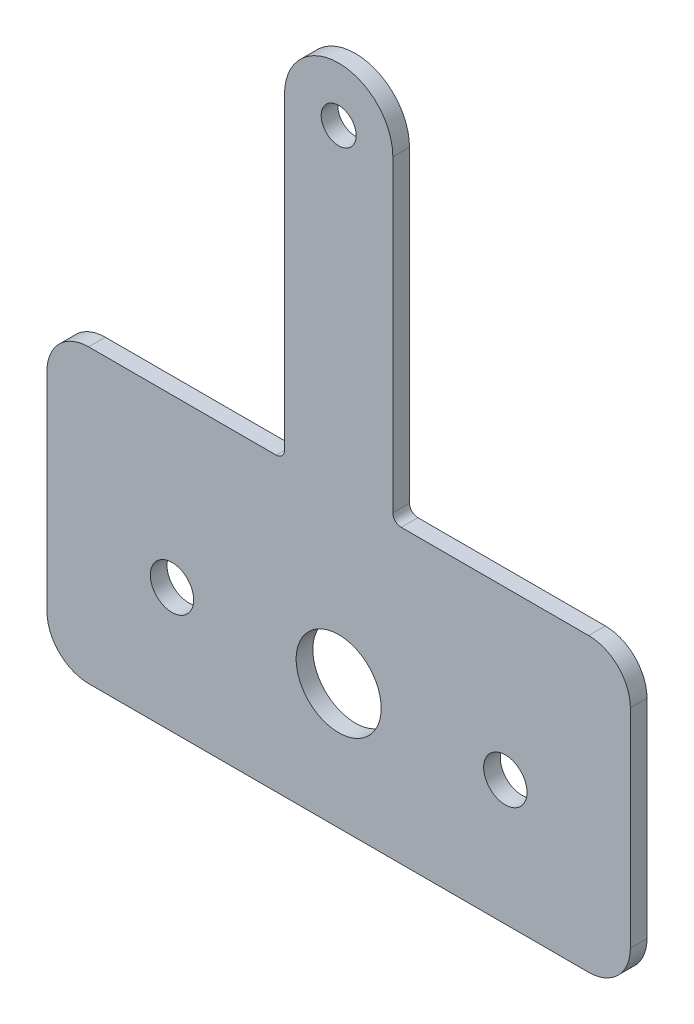
ISO-10303-21;
HEADER;
FILE_DESCRIPTION(('STEP AP214'),'2;1');
FILE_NAME('part.step','',(''),(''),'','','');
FILE_SCHEMA(('AUTOMOTIVE_DESIGN { 1 0 10303 214 1 1 1 1 }'));
ENDSEC;
DATA;
#1=APPLICATION_CONTEXT('core data for automotive mechanical design processes');
#2=APPLICATION_PROTOCOL_DEFINITION('international standard','automotive_design',2000,#1);
#3=PRODUCT_CONTEXT('',#1,'mechanical');
#4=PRODUCT('Part','Part','',(#3));
#5=PRODUCT_RELATED_PRODUCT_CATEGORY('part','',(#4));
#6=PRODUCT_DEFINITION_FORMATION('','',#4);
#7=PRODUCT_DEFINITION_CONTEXT('part definition',#1,'design');
#8=PRODUCT_DEFINITION('design','',#6,#7);
#9=PRODUCT_DEFINITION_SHAPE('','',#8);
#10=(LENGTH_UNIT() NAMED_UNIT(*) SI_UNIT(.MILLI.,.METRE.));
#11=(NAMED_UNIT(*) PLANE_ANGLE_UNIT() SI_UNIT($,.RADIAN.));
#12=(NAMED_UNIT(*) SI_UNIT($,.STERADIAN.) SOLID_ANGLE_UNIT());
#13=UNCERTAINTY_MEASURE_WITH_UNIT(LENGTH_MEASURE(1.E-05),#10,'distance_accuracy_value','');
#14=(GEOMETRIC_REPRESENTATION_CONTEXT(3) GLOBAL_UNCERTAINTY_ASSIGNED_CONTEXT((#13)) GLOBAL_UNIT_ASSIGNED_CONTEXT((#10,
#11,#12)) REPRESENTATION_CONTEXT('',''));
#15=CARTESIAN_POINT('',(0.,0.,0.));
#16=DIRECTION('',(0.,0.,1.));
#17=DIRECTION('',(1.,0.,0.));
#18=AXIS2_PLACEMENT_3D('',#15,#16,#17);
#19=CARTESIAN_POINT('',(0.,58.,-2.));
#20=DIRECTION('',(0.,0.,1.));
#21=DIRECTION('',(1.,0.,0.));
#22=AXIS2_PLACEMENT_3D('',#19,#20,#21);
#23=CYLINDRICAL_SURFACE('',#22,6.5);
#24=CARTESIAN_POINT('',(0.,58.,0.));
#25=DIRECTION('',(0.,0.,1.));
#26=DIRECTION('',(1.,0.,0.));
#27=AXIS2_PLACEMENT_3D('',#24,#25,#26);
#28=CIRCLE('',#27,6.5);
#29=CARTESIAN_POINT('',(6.50000000000005,58.,0.));
#30=VERTEX_POINT('',#29);
#31=CARTESIAN_POINT('',(-6.49999999999995,58.,0.));
#32=VERTEX_POINT('',#31);
#33=EDGE_CURVE('E172',#30,#32,#28,.T.);
#34=ORIENTED_EDGE('',*,*,#33,.F.);
#35=DIRECTION('',(0.,0.,1.));
#36=VECTOR('',#35,1.);
#37=CARTESIAN_POINT('',(6.50000000000005,58.,-2.));
#38=LINE('',#37,#36);
#39=CARTESIAN_POINT('',(6.50000000000005,58.,-2.));
#40=VERTEX_POINT('',#39);
#41=EDGE_CURVE('E11',#40,#30,#38,.T.);
#42=ORIENTED_EDGE('',*,*,#41,.F.);
#43=CARTESIAN_POINT('',(0.,58.,-2.));
#44=DIRECTION('',(0.,0.,1.));
#45=DIRECTION('',(1.,0.,0.));
#46=AXIS2_PLACEMENT_3D('',#43,#44,#45);
#47=CIRCLE('',#46,6.5);
#48=CARTESIAN_POINT('',(-6.49999999999995,58.,-2.));
#49=VERTEX_POINT('',#48);
#50=EDGE_CURVE('E211',#40,#49,#47,.T.);
#51=ORIENTED_EDGE('',*,*,#50,.T.);
#52=DIRECTION('',(0.,0.,1.));
#53=VECTOR('',#52,1.);
#54=CARTESIAN_POINT('',(-6.49999999999995,58.,-2.));
#55=LINE('',#54,#53);
#56=EDGE_CURVE('E42',#49,#32,#55,.T.);
#57=ORIENTED_EDGE('',*,*,#56,.T.);
#58=EDGE_LOOP('',(#34,#42,#51,#57));
#59=FACE_BOUND('',#58,.T.);
#60=ADVANCED_FACE('F39',(#59),#23,.T.);
#61=CARTESIAN_POINT('',(6.50000000000005,58.,-2.));
#62=DIRECTION('',(1.,0.,0.));
#63=DIRECTION('',(0.,1.,0.));
#64=AXIS2_PLACEMENT_3D('',#61,#62,#63);
#65=PLANE('',#64);
#66=DIRECTION('',(0.,1.,0.));
#67=VECTOR('',#66,1.);
#68=CARTESIAN_POINT('',(6.50000000000005,58.,0.));
#69=LINE('',#68,#67);
#70=CARTESIAN_POINT('',(6.50000000000002,21.,0.));
#71=VERTEX_POINT('',#70);
#72=EDGE_CURVE('E209',#71,#30,#69,.T.);
#73=ORIENTED_EDGE('',*,*,#72,.F.);
#74=DIRECTION('',(0.,0.,1.));
#75=VECTOR('',#74,1.);
#76=CARTESIAN_POINT('',(6.50000000000002,21.,-2.));
#77=LINE('',#76,#75);
#78=CARTESIAN_POINT('',(6.50000000000002,21.,-2.));
#79=VERTEX_POINT('',#78);
#80=EDGE_CURVE('E48',#79,#71,#77,.T.);
#81=ORIENTED_EDGE('',*,*,#80,.F.);
#82=DIRECTION('',(0.,1.,0.));
#83=VECTOR('',#82,1.);
#84=CARTESIAN_POINT('',(6.50000000000005,58.,-2.));
#85=LINE('',#84,#83);
#86=EDGE_CURVE('E162',#79,#40,#85,.T.);
#87=ORIENTED_EDGE('',*,*,#86,.T.);
#88=ORIENTED_EDGE('',*,*,#41,.T.);
#89=EDGE_LOOP('',(#73,#81,#87,#88));
#90=FACE_BOUND('',#89,.T.);
#91=ADVANCED_FACE('F235',(#90),#65,.T.);
#92=CARTESIAN_POINT('',(7.50000000000002,21.,-2.));
#93=DIRECTION('',(0.,0.,1.));
#94=DIRECTION('',(1.,0.,0.));
#95=AXIS2_PLACEMENT_3D('',#92,#93,#94);
#96=CYLINDRICAL_SURFACE('',#95,1.);
#97=CARTESIAN_POINT('',(7.50000000000002,21.,0.));
#98=DIRECTION('',(0.,0.,-1.));
#99=DIRECTION('',(1.,0.,0.));
#100=AXIS2_PLACEMENT_3D('',#97,#98,#99);
#101=CIRCLE('',#100,1.);
#102=CARTESIAN_POINT('',(7.50000000000002,20.,0.));
#103=VERTEX_POINT('',#102);
#104=EDGE_CURVE('E149',#103,#71,#101,.T.);
#105=ORIENTED_EDGE('',*,*,#104,.F.);
#106=DIRECTION('',(0.,0.,1.));
#107=VECTOR('',#106,1.);
#108=CARTESIAN_POINT('',(7.50000000000002,20.,-2.));
#109=LINE('',#108,#107);
#110=CARTESIAN_POINT('',(7.50000000000002,20.,-2.));
#111=VERTEX_POINT('',#110);
#112=EDGE_CURVE('E144',#111,#103,#109,.T.);
#113=ORIENTED_EDGE('',*,*,#112,.F.);
#114=CARTESIAN_POINT('',(7.50000000000002,21.,-2.));
#115=DIRECTION('',(0.,0.,-1.));
#116=DIRECTION('',(1.,0.,0.));
#117=AXIS2_PLACEMENT_3D('',#114,#115,#116);
#118=CIRCLE('',#117,1.);
#119=EDGE_CURVE('E147',#111,#79,#118,.T.);
#120=ORIENTED_EDGE('',*,*,#119,.T.);
#121=ORIENTED_EDGE('',*,*,#80,.T.);
#122=EDGE_LOOP('',(#105,#113,#120,#121));
#123=FACE_BOUND('',#122,.T.);
#124=ADVANCED_FACE('F146',(#123),#96,.F.);
#125=CARTESIAN_POINT('',(30.,20.,-2.));
#126=DIRECTION('',(0.,1.,0.));
#127=DIRECTION('',(-1.,0.,0.));
#128=AXIS2_PLACEMENT_3D('',#125,#126,#127);
#129=PLANE('',#128);
#130=DIRECTION('',(-1.,0.,0.));
#131=VECTOR('',#130,1.);
#132=CARTESIAN_POINT('',(30.,20.,0.));
#133=LINE('',#132,#131);
#134=CARTESIAN_POINT('',(30.,20.,0.));
#135=VERTEX_POINT('',#134);
#136=EDGE_CURVE('E206',#135,#103,#133,.T.);
#137=ORIENTED_EDGE('',*,*,#136,.F.);
#138=DIRECTION('',(0.,0.,1.));
#139=VECTOR('',#138,1.);
#140=CARTESIAN_POINT('',(30.,20.,-2.));
#141=LINE('',#140,#139);
#142=CARTESIAN_POINT('',(30.,20.,-2.));
#143=VERTEX_POINT('',#142);
#144=EDGE_CURVE('E154',#143,#135,#141,.T.);
#145=ORIENTED_EDGE('',*,*,#144,.F.);
#146=DIRECTION('',(-1.,0.,0.));
#147=VECTOR('',#146,1.);
#148=CARTESIAN_POINT('',(30.,20.,-2.));
#149=LINE('',#148,#147);
#150=EDGE_CURVE('E160',#143,#111,#149,.T.);
#151=ORIENTED_EDGE('',*,*,#150,.T.);
#152=ORIENTED_EDGE('',*,*,#112,.T.);
#153=EDGE_LOOP('',(#137,#145,#151,#152));
#154=FACE_BOUND('',#153,.T.);
#155=ADVANCED_FACE('F164',(#154),#129,.T.);
#156=CARTESIAN_POINT('',(30.,15.,-2.));
#157=DIRECTION('',(0.,0.,1.));
#158=DIRECTION('',(1.,0.,0.));
#159=AXIS2_PLACEMENT_3D('',#156,#157,#158);
#160=CYLINDRICAL_SURFACE('',#159,5.);
#161=CARTESIAN_POINT('',(30.,15.,0.));
#162=DIRECTION('',(0.,0.,1.));
#163=DIRECTION('',(1.,0.,0.));
#164=AXIS2_PLACEMENT_3D('',#161,#162,#163);
#165=CIRCLE('',#164,5.);
#166=CARTESIAN_POINT('',(35.,15.,0.));
#167=VERTEX_POINT('',#166);
#168=EDGE_CURVE('E203',#167,#135,#165,.T.);
#169=ORIENTED_EDGE('',*,*,#168,.F.);
#170=DIRECTION('',(0.,0.,1.));
#171=VECTOR('',#170,1.);
#172=CARTESIAN_POINT('',(35.,15.,-2.));
#173=LINE('',#172,#171);
#174=CARTESIAN_POINT('',(35.,15.,-2.));
#175=VERTEX_POINT('',#174);
#176=EDGE_CURVE('E215',#175,#167,#173,.T.);
#177=ORIENTED_EDGE('',*,*,#176,.F.);
#178=CARTESIAN_POINT('',(30.,15.,-2.));
#179=DIRECTION('',(0.,0.,1.));
#180=DIRECTION('',(1.,0.,0.));
#181=AXIS2_PLACEMENT_3D('',#178,#179,#180);
#182=CIRCLE('',#181,5.);
#183=EDGE_CURVE('E165',#175,#143,#182,.T.);
#184=ORIENTED_EDGE('',*,*,#183,.T.);
#185=ORIENTED_EDGE('',*,*,#144,.T.);
#186=EDGE_LOOP('',(#169,#177,#184,#185));
#187=FACE_BOUND('',#186,.T.);
#188=ADVANCED_FACE('F248',(#187),#160,.T.);
#189=CARTESIAN_POINT('',(35.,-10.,-2.));
#190=DIRECTION('',(1.,0.,0.));
#191=DIRECTION('',(0.,1.,0.));
#192=AXIS2_PLACEMENT_3D('',#189,#190,#191);
#193=PLANE('',#192);
#194=DIRECTION('',(0.,1.,0.));
#195=VECTOR('',#194,1.);
#196=CARTESIAN_POINT('',(35.,-10.,0.));
#197=LINE('',#196,#195);
#198=CARTESIAN_POINT('',(35.,-10.,0.));
#199=VERTEX_POINT('',#198);
#200=EDGE_CURVE('E200',#199,#167,#197,.T.);
#201=ORIENTED_EDGE('',*,*,#200,.F.);
#202=DIRECTION('',(0.,0.,1.));
#203=VECTOR('',#202,1.);
#204=CARTESIAN_POINT('',(35.,-10.,-2.));
#205=LINE('',#204,#203);
#206=CARTESIAN_POINT('',(35.,-10.,-2.));
#207=VERTEX_POINT('',#206);
#208=EDGE_CURVE('E217',#207,#199,#205,.T.);
#209=ORIENTED_EDGE('',*,*,#208,.F.);
#210=DIRECTION('',(0.,1.,0.));
#211=VECTOR('',#210,1.);
#212=CARTESIAN_POINT('',(35.,-10.,-2.));
#213=LINE('',#212,#211);
#214=EDGE_CURVE('E167',#207,#175,#213,.T.);
#215=ORIENTED_EDGE('',*,*,#214,.T.);
#216=ORIENTED_EDGE('',*,*,#176,.T.);
#217=EDGE_LOOP('',(#201,#209,#215,#216));
#218=FACE_BOUND('',#217,.T.);
#219=ADVANCED_FACE('F251',(#218),#193,.T.);
#220=CARTESIAN_POINT('',(30.,-10.,-2.));
#221=DIRECTION('',(0.,0.,1.));
#222=DIRECTION('',(1.,0.,0.));
#223=AXIS2_PLACEMENT_3D('',#220,#221,#222);
#224=CYLINDRICAL_SURFACE('',#223,5.);
#225=CARTESIAN_POINT('',(30.,-10.,0.));
#226=DIRECTION('',(0.,0.,1.));
#227=DIRECTION('',(1.,0.,0.));
#228=AXIS2_PLACEMENT_3D('',#225,#226,#227);
#229=CIRCLE('',#228,5.);
#230=CARTESIAN_POINT('',(30.,-15.,0.));
#231=VERTEX_POINT('',#230);
#232=EDGE_CURVE('E197',#231,#199,#229,.T.);
#233=ORIENTED_EDGE('',*,*,#232,.F.);
#234=DIRECTION('',(0.,0.,1.));
#235=VECTOR('',#234,1.);
#236=CARTESIAN_POINT('',(30.,-15.,-2.));
#237=LINE('',#236,#235);
#238=CARTESIAN_POINT('',(30.,-15.,-2.));
#239=VERTEX_POINT('',#238);
#240=EDGE_CURVE('E219',#239,#231,#237,.T.);
#241=ORIENTED_EDGE('',*,*,#240,.F.);
#242=CARTESIAN_POINT('',(30.,-10.,-2.));
#243=DIRECTION('',(0.,0.,1.));
#244=DIRECTION('',(1.,0.,0.));
#245=AXIS2_PLACEMENT_3D('',#242,#243,#244);
#246=CIRCLE('',#245,5.);
#247=EDGE_CURVE('E359',#239,#207,#246,.T.);
#248=ORIENTED_EDGE('',*,*,#247,.T.);
#249=ORIENTED_EDGE('',*,*,#208,.T.);
#250=EDGE_LOOP('',(#233,#241,#248,#249));
#251=FACE_BOUND('',#250,.T.);
#252=ADVANCED_FACE('F255',(#251),#224,.T.);
#253=CARTESIAN_POINT('',(-30.,-15.,-2.));
#254=DIRECTION('',(0.,-1.,0.));
#255=DIRECTION('',(0.,0.,-1.));
#256=AXIS2_PLACEMENT_3D('',#253,#254,#255);
#257=PLANE('',#256);
#258=DIRECTION('',(1.,0.,0.));
#259=VECTOR('',#258,1.);
#260=CARTESIAN_POINT('',(-30.,-15.,0.));
#261=LINE('',#260,#259);
#262=CARTESIAN_POINT('',(-30.,-15.,0.));
#263=VERTEX_POINT('',#262);
#264=EDGE_CURVE('E194',#263,#231,#261,.T.);
#265=ORIENTED_EDGE('',*,*,#264,.F.);
#266=DIRECTION('',(0.,0.,1.));
#267=VECTOR('',#266,1.);
#268=CARTESIAN_POINT('',(-30.,-15.,-2.));
#269=LINE('',#268,#267);
#270=CARTESIAN_POINT('',(-30.,-15.,-2.));
#271=VERTEX_POINT('',#270);
#272=EDGE_CURVE('E221',#271,#263,#269,.T.);
#273=ORIENTED_EDGE('',*,*,#272,.F.);
#274=DIRECTION('',(1.,0.,0.));
#275=VECTOR('',#274,1.);
#276=CARTESIAN_POINT('',(-30.,-15.,-2.));
#277=LINE('',#276,#275);
#278=EDGE_CURVE('E356',#271,#239,#277,.T.);
#279=ORIENTED_EDGE('',*,*,#278,.T.);
#280=ORIENTED_EDGE('',*,*,#240,.T.);
#281=EDGE_LOOP('',(#265,#273,#279,#280));
#282=FACE_BOUND('',#281,.T.);
#283=ADVANCED_FACE('F259',(#282),#257,.T.);
#284=CARTESIAN_POINT('',(-30.,-10.,-2.));
#285=DIRECTION('',(0.,0.,1.));
#286=DIRECTION('',(1.,0.,0.));
#287=AXIS2_PLACEMENT_3D('',#284,#285,#286);
#288=CYLINDRICAL_SURFACE('',#287,5.00000000000001);
#289=CARTESIAN_POINT('',(-30.,-10.,0.));
#290=DIRECTION('',(0.,0.,1.));
#291=DIRECTION('',(1.,0.,0.));
#292=AXIS2_PLACEMENT_3D('',#289,#290,#291);
#293=CIRCLE('',#292,5.00000000000001);
#294=CARTESIAN_POINT('',(-35.,-10.,0.));
#295=VERTEX_POINT('',#294);
#296=EDGE_CURVE('E191',#295,#263,#293,.T.);
#297=ORIENTED_EDGE('',*,*,#296,.F.);
#298=DIRECTION('',(0.,0.,1.));
#299=VECTOR('',#298,1.);
#300=CARTESIAN_POINT('',(-35.,-10.,-2.));
#301=LINE('',#300,#299);
#302=CARTESIAN_POINT('',(-35.,-10.,-2.));
#303=VERTEX_POINT('',#302);
#304=EDGE_CURVE('E223',#303,#295,#301,.T.);
#305=ORIENTED_EDGE('',*,*,#304,.F.);
#306=CARTESIAN_POINT('',(-30.,-10.,-2.));
#307=DIRECTION('',(0.,0.,1.));
#308=DIRECTION('',(1.,0.,0.));
#309=AXIS2_PLACEMENT_3D('',#306,#307,#308);
#310=CIRCLE('',#309,5.00000000000001);
#311=EDGE_CURVE('E353',#303,#271,#310,.T.);
#312=ORIENTED_EDGE('',*,*,#311,.T.);
#313=ORIENTED_EDGE('',*,*,#272,.T.);
#314=EDGE_LOOP('',(#297,#305,#312,#313));
#315=FACE_BOUND('',#314,.T.);
#316=ADVANCED_FACE('F263',(#315),#288,.T.);
#317=CARTESIAN_POINT('',(-35.,15.,-2.));
#318=DIRECTION('',(-1.,0.,0.));
#319=DIRECTION('',(0.,-1.,0.));
#320=AXIS2_PLACEMENT_3D('',#317,#318,#319);
#321=PLANE('',#320);
#322=DIRECTION('',(0.,-1.,0.));
#323=VECTOR('',#322,1.);
#324=CARTESIAN_POINT('',(-35.,15.,0.));
#325=LINE('',#324,#323);
#326=CARTESIAN_POINT('',(-35.,15.,0.));
#327=VERTEX_POINT('',#326);
#328=EDGE_CURVE('E188',#327,#295,#325,.T.);
#329=ORIENTED_EDGE('',*,*,#328,.F.);
#330=DIRECTION('',(0.,0.,1.));
#331=VECTOR('',#330,1.);
#332=CARTESIAN_POINT('',(-35.,15.,-2.));
#333=LINE('',#332,#331);
#334=CARTESIAN_POINT('',(-35.,15.,-2.));
#335=VERTEX_POINT('',#334);
#336=EDGE_CURVE('E225',#335,#327,#333,.T.);
#337=ORIENTED_EDGE('',*,*,#336,.F.);
#338=DIRECTION('',(0.,-1.,0.));
#339=VECTOR('',#338,1.);
#340=CARTESIAN_POINT('',(-35.,15.,-2.));
#341=LINE('',#340,#339);
#342=EDGE_CURVE('E350',#335,#303,#341,.T.);
#343=ORIENTED_EDGE('',*,*,#342,.T.);
#344=ORIENTED_EDGE('',*,*,#304,.T.);
#345=EDGE_LOOP('',(#329,#337,#343,#344));
#346=FACE_BOUND('',#345,.T.);
#347=ADVANCED_FACE('F267',(#346),#321,.T.);
#348=CARTESIAN_POINT('',(-30.,15.,-2.));
#349=DIRECTION('',(0.,0.,1.));
#350=DIRECTION('',(1.,0.,0.));
#351=AXIS2_PLACEMENT_3D('',#348,#349,#350);
#352=CYLINDRICAL_SURFACE('',#351,5.);
#353=CARTESIAN_POINT('',(-30.,15.,0.));
#354=DIRECTION('',(0.,0.,1.));
#355=DIRECTION('',(-1.,0.,0.));
#356=AXIS2_PLACEMENT_3D('',#353,#354,#355);
#357=CIRCLE('',#356,5.);
#358=CARTESIAN_POINT('',(-30.,20.,0.));
#359=VERTEX_POINT('',#358);
#360=EDGE_CURVE('E185',#359,#327,#357,.T.);
#361=ORIENTED_EDGE('',*,*,#360,.F.);
#362=DIRECTION('',(0.,0.,1.));
#363=VECTOR('',#362,1.);
#364=CARTESIAN_POINT('',(-30.,20.,-2.));
#365=LINE('',#364,#363);
#366=CARTESIAN_POINT('',(-30.,20.,-2.));
#367=VERTEX_POINT('',#366);
#368=EDGE_CURVE('E227',#367,#359,#365,.T.);
#369=ORIENTED_EDGE('',*,*,#368,.F.);
#370=CARTESIAN_POINT('',(-30.,15.,-2.));
#371=DIRECTION('',(0.,0.,1.));
#372=DIRECTION('',(-1.,0.,0.));
#373=AXIS2_PLACEMENT_3D('',#370,#371,#372);
#374=CIRCLE('',#373,5.);
#375=EDGE_CURVE('E347',#367,#335,#374,.T.);
#376=ORIENTED_EDGE('',*,*,#375,.T.);
#377=ORIENTED_EDGE('',*,*,#336,.T.);
#378=EDGE_LOOP('',(#361,#369,#376,#377));
#379=FACE_BOUND('',#378,.T.);
#380=ADVANCED_FACE('F271',(#379),#352,.T.);
#381=CARTESIAN_POINT('',(-7.49999999999999,20.,-2.));
#382=DIRECTION('',(0.,1.,0.));
#383=DIRECTION('',(-1.,0.,0.));
#384=AXIS2_PLACEMENT_3D('',#381,#382,#383);
#385=PLANE('',#384);
#386=DIRECTION('',(-1.,0.,0.));
#387=VECTOR('',#386,1.);
#388=CARTESIAN_POINT('',(-7.49999999999999,20.,0.));
#389=LINE('',#388,#387);
#390=CARTESIAN_POINT('',(-7.49999999999999,20.,0.));
#391=VERTEX_POINT('',#390);
#392=EDGE_CURVE('E182',#391,#359,#389,.T.);
#393=ORIENTED_EDGE('',*,*,#392,.F.);
#394=DIRECTION('',(0.,0.,1.));
#395=VECTOR('',#394,1.);
#396=CARTESIAN_POINT('',(-7.49999999999999,20.,-2.));
#397=LINE('',#396,#395);
#398=CARTESIAN_POINT('',(-7.49999999999999,20.,-2.));
#399=VERTEX_POINT('',#398);
#400=EDGE_CURVE('E229',#399,#391,#397,.T.);
#401=ORIENTED_EDGE('',*,*,#400,.F.);
#402=DIRECTION('',(-1.,0.,0.));
#403=VECTOR('',#402,1.);
#404=CARTESIAN_POINT('',(-7.49999999999999,20.,-2.));
#405=LINE('',#404,#403);
#406=EDGE_CURVE('E344',#399,#367,#405,.T.);
#407=ORIENTED_EDGE('',*,*,#406,.T.);
#408=ORIENTED_EDGE('',*,*,#368,.T.);
#409=EDGE_LOOP('',(#393,#401,#407,#408));
#410=FACE_BOUND('',#409,.T.);
#411=ADVANCED_FACE('F275',(#410),#385,.T.);
#412=CARTESIAN_POINT('',(-7.49999999999999,21.,-2.));
#413=DIRECTION('',(0.,0.,1.));
#414=DIRECTION('',(1.,0.,0.));
#415=AXIS2_PLACEMENT_3D('',#412,#413,#414);
#416=CYLINDRICAL_SURFACE('',#415,1.);
#417=CARTESIAN_POINT('',(-7.49999999999999,21.,0.));
#418=DIRECTION('',(0.,0.,-1.));
#419=DIRECTION('',(-1.,0.,0.));
#420=AXIS2_PLACEMENT_3D('',#417,#418,#419);
#421=CIRCLE('',#420,1.);
#422=CARTESIAN_POINT('',(-6.49999999999999,21.,0.));
#423=VERTEX_POINT('',#422);
#424=EDGE_CURVE('E179',#423,#391,#421,.T.);
#425=ORIENTED_EDGE('',*,*,#424,.F.);
#426=DIRECTION('',(0.,0.,1.));
#427=VECTOR('',#426,1.);
#428=CARTESIAN_POINT('',(-6.49999999999999,21.,-2.));
#429=LINE('',#428,#427);
#430=CARTESIAN_POINT('',(-6.49999999999999,21.,-2.));
#431=VERTEX_POINT('',#430);
#432=EDGE_CURVE('E230',#431,#423,#429,.T.);
#433=ORIENTED_EDGE('',*,*,#432,.F.);
#434=CARTESIAN_POINT('',(-7.49999999999999,21.,-2.));
#435=DIRECTION('',(0.,0.,-1.));
#436=DIRECTION('',(-1.,0.,0.));
#437=AXIS2_PLACEMENT_3D('',#434,#435,#436);
#438=CIRCLE('',#437,1.);
#439=EDGE_CURVE('E341',#431,#399,#438,.T.);
#440=ORIENTED_EDGE('',*,*,#439,.T.);
#441=ORIENTED_EDGE('',*,*,#400,.T.);
#442=EDGE_LOOP('',(#425,#433,#440,#441));
#443=FACE_BOUND('',#442,.T.);
#444=ADVANCED_FACE('F279',(#443),#416,.F.);
#445=CARTESIAN_POINT('',(-6.49999999999995,58.,-2.));
#446=DIRECTION('',(-1.,0.,0.));
#447=DIRECTION('',(0.,-1.,0.));
#448=AXIS2_PLACEMENT_3D('',#445,#446,#447);
#449=PLANE('',#448);
#450=DIRECTION('',(0.,-1.,0.));
#451=VECTOR('',#450,1.);
#452=CARTESIAN_POINT('',(-6.49999999999995,58.,0.));
#453=LINE('',#452,#451);
#454=EDGE_CURVE('E175',#32,#423,#453,.T.);
#455=ORIENTED_EDGE('',*,*,#454,.F.);
#456=ORIENTED_EDGE('',*,*,#56,.F.);
#457=DIRECTION('',(0.,-1.,0.));
#458=VECTOR('',#457,1.);
#459=CARTESIAN_POINT('',(-6.49999999999995,58.,-2.));
#460=LINE('',#459,#458);
#461=EDGE_CURVE('E339',#49,#431,#460,.T.);
#462=ORIENTED_EDGE('',*,*,#461,.T.);
#463=ORIENTED_EDGE('',*,*,#432,.T.);
#464=EDGE_LOOP('',(#455,#456,#462,#463));
#465=FACE_BOUND('',#464,.T.);
#466=ADVANCED_FACE('F232',(#465),#449,.T.);
#467=CARTESIAN_POINT('',(0.,58.,-2.));
#468=DIRECTION('',(0.,0.,1.));
#469=DIRECTION('',(1.,0.,0.));
#470=AXIS2_PLACEMENT_3D('',#467,#468,#469);
#471=PLANE('',#470);
#472=CARTESIAN_POINT('',(0.,58.,-2.));
#473=DIRECTION('',(0.,0.,1.));
#474=DIRECTION('',(1.,0.,0.));
#475=AXIS2_PLACEMENT_3D('',#472,#473,#474);
#476=CIRCLE('',#475,2.1);
#477=CARTESIAN_POINT('',(2.09999999999998,58.,-2.));
#478=VERTEX_POINT('',#477);
#479=EDGE_CURVE('E314',#478,#478,#476,.T.);
#480=ORIENTED_EDGE('',*,*,#479,.T.);
#481=EDGE_LOOP('',(#480));
#482=FACE_BOUND('',#481,.T.);
#483=CARTESIAN_POINT('',(20.,0.,-2.));
#484=DIRECTION('',(0.,0.,1.));
#485=DIRECTION('',(1.,0.,0.));
#486=AXIS2_PLACEMENT_3D('',#483,#484,#485);
#487=CIRCLE('',#486,2.6);
#488=CARTESIAN_POINT('',(22.6,0.,-2.));
#489=VERTEX_POINT('',#488);
#490=EDGE_CURVE('E322',#489,#489,#487,.T.);
#491=ORIENTED_EDGE('',*,*,#490,.T.);
#492=EDGE_LOOP('',(#491));
#493=FACE_BOUND('',#492,.T.);
#494=CARTESIAN_POINT('',(0.,0.,-2.));
#495=DIRECTION('',(0.,0.,1.));
#496=DIRECTION('',(1.,0.,0.));
#497=AXIS2_PLACEMENT_3D('',#494,#495,#496);
#498=CIRCLE('',#497,5.1);
#499=CARTESIAN_POINT('',(5.1,0.,-2.));
#500=VERTEX_POINT('',#499);
#501=EDGE_CURVE('E328',#500,#500,#498,.T.);
#502=ORIENTED_EDGE('',*,*,#501,.T.);
#503=EDGE_LOOP('',(#502));
#504=FACE_BOUND('',#503,.T.);
#505=CARTESIAN_POINT('',(-20.,0.,-2.));
#506=DIRECTION('',(0.,0.,1.));
#507=DIRECTION('',(1.,0.,0.));
#508=AXIS2_PLACEMENT_3D('',#505,#506,#507);
#509=CIRCLE('',#508,2.6);
#510=CARTESIAN_POINT('',(-17.4,0.,-2.));
#511=VERTEX_POINT('',#510);
#512=EDGE_CURVE('E176',#511,#511,#509,.T.);
#513=ORIENTED_EDGE('',*,*,#512,.T.);
#514=EDGE_LOOP('',(#513));
#515=FACE_BOUND('',#514,.T.);
#516=ORIENTED_EDGE('',*,*,#50,.F.);
#517=ORIENTED_EDGE('',*,*,#86,.F.);
#518=ORIENTED_EDGE('',*,*,#119,.F.);
#519=ORIENTED_EDGE('',*,*,#150,.F.);
#520=ORIENTED_EDGE('',*,*,#183,.F.);
#521=ORIENTED_EDGE('',*,*,#214,.F.);
#522=ORIENTED_EDGE('',*,*,#247,.F.);
#523=ORIENTED_EDGE('',*,*,#278,.F.);
#524=ORIENTED_EDGE('',*,*,#311,.F.);
#525=ORIENTED_EDGE('',*,*,#342,.F.);
#526=ORIENTED_EDGE('',*,*,#375,.F.);
#527=ORIENTED_EDGE('',*,*,#406,.F.);
#528=ORIENTED_EDGE('',*,*,#439,.F.);
#529=ORIENTED_EDGE('',*,*,#461,.F.);
#530=EDGE_LOOP('',(#516,#517,#518,#519,#520,#521,#522,#523,#524,#525,#526,#527,#528,#529));
#531=FACE_BOUND('',#530,.T.);
#532=ADVANCED_FACE('F158',(#482,#493,#504,#515,#531),#471,.F.);
#533=CARTESIAN_POINT('',(0.,58.,0.));
#534=DIRECTION('',(0.,0.,1.));
#535=DIRECTION('',(1.,0.,0.));
#536=AXIS2_PLACEMENT_3D('',#533,#534,#535);
#537=PLANE('',#536);
#538=CARTESIAN_POINT('',(0.,58.,0.));
#539=DIRECTION('',(0.,0.,1.));
#540=DIRECTION('',(1.,0.,0.));
#541=AXIS2_PLACEMENT_3D('',#538,#539,#540);
#542=CIRCLE('',#541,2.1);
#543=CARTESIAN_POINT('',(2.09999999999998,58.,0.));
#544=VERTEX_POINT('',#543);
#545=EDGE_CURVE('E317',#544,#544,#542,.T.);
#546=ORIENTED_EDGE('',*,*,#545,.F.);
#547=EDGE_LOOP('',(#546));
#548=FACE_BOUND('',#547,.T.);
#549=CARTESIAN_POINT('',(20.,0.,0.));
#550=DIRECTION('',(0.,0.,1.));
#551=DIRECTION('',(1.,0.,0.));
#552=AXIS2_PLACEMENT_3D('',#549,#550,#551);
#553=CIRCLE('',#552,2.6);
#554=CARTESIAN_POINT('',(22.6,0.,0.));
#555=VERTEX_POINT('',#554);
#556=EDGE_CURVE('E319',#555,#555,#553,.T.);
#557=ORIENTED_EDGE('',*,*,#556,.F.);
#558=EDGE_LOOP('',(#557));
#559=FACE_BOUND('',#558,.T.);
#560=CARTESIAN_POINT('',(0.,0.,0.));
#561=DIRECTION('',(0.,0.,1.));
#562=DIRECTION('',(1.,0.,0.));
#563=AXIS2_PLACEMENT_3D('',#560,#561,#562);
#564=CIRCLE('',#563,5.1);
#565=CARTESIAN_POINT('',(5.1,0.,0.));
#566=VERTEX_POINT('',#565);
#567=EDGE_CURVE('E325',#566,#566,#564,.T.);
#568=ORIENTED_EDGE('',*,*,#567,.F.);
#569=EDGE_LOOP('',(#568));
#570=FACE_BOUND('',#569,.T.);
#571=CARTESIAN_POINT('',(-20.,0.,0.));
#572=DIRECTION('',(0.,0.,1.));
#573=DIRECTION('',(1.,0.,0.));
#574=AXIS2_PLACEMENT_3D('',#571,#572,#573);
#575=CIRCLE('',#574,2.6);
#576=CARTESIAN_POINT('',(-17.4,0.,0.));
#577=VERTEX_POINT('',#576);
#578=EDGE_CURVE('E331',#577,#577,#575,.T.);
#579=ORIENTED_EDGE('',*,*,#578,.F.);
#580=EDGE_LOOP('',(#579));
#581=FACE_BOUND('',#580,.T.);
#582=ORIENTED_EDGE('',*,*,#33,.T.);
#583=ORIENTED_EDGE('',*,*,#454,.T.);
#584=ORIENTED_EDGE('',*,*,#424,.T.);
#585=ORIENTED_EDGE('',*,*,#392,.T.);
#586=ORIENTED_EDGE('',*,*,#360,.T.);
#587=ORIENTED_EDGE('',*,*,#328,.T.);
#588=ORIENTED_EDGE('',*,*,#296,.T.);
#589=ORIENTED_EDGE('',*,*,#264,.T.);
#590=ORIENTED_EDGE('',*,*,#232,.T.);
#591=ORIENTED_EDGE('',*,*,#200,.T.);
#592=ORIENTED_EDGE('',*,*,#168,.T.);
#593=ORIENTED_EDGE('',*,*,#136,.T.);
#594=ORIENTED_EDGE('',*,*,#104,.T.);
#595=ORIENTED_EDGE('',*,*,#72,.T.);
#596=EDGE_LOOP('',(#582,#583,#584,#585,#586,#587,#588,#589,#590,#591,#592,#593,#594,#595));
#597=FACE_BOUND('',#596,.T.);
#598=ADVANCED_FACE('F234',(#548,#559,#570,#581,#597),#537,.T.);
#599=CARTESIAN_POINT('',(-20.,0.,-2.));
#600=DIRECTION('',(0.,0.,1.));
#601=DIRECTION('',(1.,0.,0.));
#602=AXIS2_PLACEMENT_3D('',#599,#600,#601);
#603=CYLINDRICAL_SURFACE('',#602,2.6);
#604=ORIENTED_EDGE('',*,*,#512,.F.);
#605=EDGE_LOOP('',(#604));
#606=FACE_BOUND('',#605,.T.);
#607=ORIENTED_EDGE('',*,*,#578,.T.);
#608=EDGE_LOOP('',(#607));
#609=FACE_BOUND('',#608,.T.);
#610=ADVANCED_FACE('F291',(#606,#609),#603,.F.);
#611=CARTESIAN_POINT('',(0.,0.,-2.));
#612=DIRECTION('',(0.,0.,1.));
#613=DIRECTION('',(1.,0.,0.));
#614=AXIS2_PLACEMENT_3D('',#611,#612,#613);
#615=CYLINDRICAL_SURFACE('',#614,5.1);
#616=ORIENTED_EDGE('',*,*,#501,.F.);
#617=EDGE_LOOP('',(#616));
#618=FACE_BOUND('',#617,.T.);
#619=ORIENTED_EDGE('',*,*,#567,.T.);
#620=EDGE_LOOP('',(#619));
#621=FACE_BOUND('',#620,.T.);
#622=ADVANCED_FACE('F298',(#618,#621),#615,.F.);
#623=CARTESIAN_POINT('',(20.,0.,-2.));
#624=DIRECTION('',(0.,0.,1.));
#625=DIRECTION('',(1.,0.,0.));
#626=AXIS2_PLACEMENT_3D('',#623,#624,#625);
#627=CYLINDRICAL_SURFACE('',#626,2.6);
#628=ORIENTED_EDGE('',*,*,#490,.F.);
#629=EDGE_LOOP('',(#628));
#630=FACE_BOUND('',#629,.T.);
#631=ORIENTED_EDGE('',*,*,#556,.T.);
#632=EDGE_LOOP('',(#631));
#633=FACE_BOUND('',#632,.T.);
#634=ADVANCED_FACE('F302',(#630,#633),#627,.F.);
#635=CARTESIAN_POINT('',(0.,58.,0.));
#636=DIRECTION('',(0.,0.,1.));
#637=DIRECTION('',(1.,0.,0.));
#638=AXIS2_PLACEMENT_3D('',#635,#636,#637);
#639=CYLINDRICAL_SURFACE('',#638,2.1);
#640=ORIENTED_EDGE('',*,*,#479,.F.);
#641=EDGE_LOOP('',(#640));
#642=FACE_BOUND('',#641,.T.);
#643=ORIENTED_EDGE('',*,*,#545,.T.);
#644=EDGE_LOOP('',(#643));
#645=FACE_BOUND('',#644,.T.);
#646=ADVANCED_FACE('F306',(#642,#645),#639,.F.);
#647=CLOSED_SHELL('',(#60,#91,#124,#155,#188,#219,#252,#283,#316,#347,#380,#411,#444,#466,#532,
#598,#610,#622,#634,#646));
#648=MANIFOLD_SOLID_BREP('B2',#647);
#649=ADVANCED_BREP_SHAPE_REPRESENTATION('',(#18,#648),#14);
#650=SHAPE_DEFINITION_REPRESENTATION(#9,#649);
ENDSEC;
END-ISO-10303-21;
